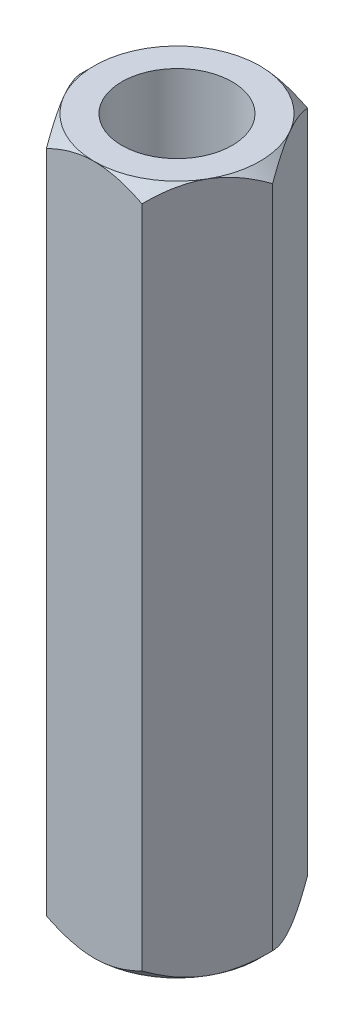
ISO-10303-21;
HEADER;
FILE_DESCRIPTION(('STEP AP214'),'2;1');
FILE_NAME('part.step','',(''),(''),'','','');
FILE_SCHEMA(('AUTOMOTIVE_DESIGN { 1 0 10303 214 1 1 1 1 }'));
ENDSEC;
DATA;
#1=APPLICATION_CONTEXT('core data for automotive mechanical design processes');
#2=APPLICATION_PROTOCOL_DEFINITION('international standard','automotive_design',2000,#1);
#3=PRODUCT_CONTEXT('',#1,'mechanical');
#4=PRODUCT('Part','Part','',(#3));
#5=PRODUCT_RELATED_PRODUCT_CATEGORY('part','',(#4));
#6=PRODUCT_DEFINITION_FORMATION('','',#4);
#7=PRODUCT_DEFINITION_CONTEXT('part definition',#1,'design');
#8=PRODUCT_DEFINITION('design','',#6,#7);
#9=PRODUCT_DEFINITION_SHAPE('','',#8);
#10=(LENGTH_UNIT() NAMED_UNIT(*) SI_UNIT(.MILLI.,.METRE.));
#11=(NAMED_UNIT(*) PLANE_ANGLE_UNIT() SI_UNIT($,.RADIAN.));
#12=(NAMED_UNIT(*) SI_UNIT($,.STERADIAN.) SOLID_ANGLE_UNIT());
#13=UNCERTAINTY_MEASURE_WITH_UNIT(LENGTH_MEASURE(1.E-05),#10,'distance_accuracy_value','');
#14=(GEOMETRIC_REPRESENTATION_CONTEXT(3) GLOBAL_UNCERTAINTY_ASSIGNED_CONTEXT((#13)) GLOBAL_UNIT_ASSIGNED_CONTEXT((#10,
#11,#12)) REPRESENTATION_CONTEXT('',''));
#15=CARTESIAN_POINT('',(0.,0.,0.));
#16=DIRECTION('',(0.,0.,1.));
#17=DIRECTION('',(1.,0.,0.));
#18=AXIS2_PLACEMENT_3D('',#15,#16,#17);
#19=CARTESIAN_POINT('',(0.,0.500000000000007,0.));
#20=DIRECTION('',(0.,1.,0.));
#21=DIRECTION('',(0.,0.,1.));
#22=AXIS2_PLACEMENT_3D('',#19,#20,#21);
#23=CONICAL_SURFACE('',#22,3.5,0.785398163397449);
#24=CARTESIAN_POINT('',(-3.62915516946139,1.70858442039945,-3.));
#25=CARTESIAN_POINT('',(-3.54153211272357,1.64106383964874,-3.));
#26=CARTESIAN_POINT('',(-3.45343857910553,1.57414424358293,-3.));
#27=CARTESIAN_POINT('',(-3.27611767023116,1.44178206977251,-3.));
#28=CARTESIAN_POINT('',(-3.18689003301499,1.37633984333659,-3.));
#29=CARTESIAN_POINT('',(-3.00645615703304,1.24674179351404,-3.));
#30=CARTESIAN_POINT('',(-2.91523996696214,1.18259977975863,-3.));
#31=CARTESIAN_POINT('',(-2.73129233813018,1.05653409897249,-3.));
#32=CARTESIAN_POINT('',(-2.63856100412977,0.994610279507754,-3.));
#33=CARTESIAN_POINT('',(-2.44533724608063,0.869612511053117,-3.));
#34=CARTESIAN_POINT('',(-2.34472785867827,0.806718459888562,-3.));
#35=CARTESIAN_POINT('',(-2.14114550054073,0.684814079831247,-3.));
#36=CARTESIAN_POINT('',(-2.03817213392274,0.625804407928502,-3.));
#37=CARTESIAN_POINT('',(-1.82983029570639,0.51292396153963,-3.));
#38=CARTESIAN_POINT('',(-1.7244700593887,0.459038106157615,-3.));
#39=CARTESIAN_POINT('',(-1.51076215022669,0.35761264365954,-3.));
#40=CARTESIAN_POINT('',(-1.40241592112307,0.310070032324291,-3.));
#41=CARTESIAN_POINT('',(-1.19351356903438,0.227417700688498,-3.));
#42=CARTESIAN_POINT('',(-1.09326459374811,0.19153955198719,-3.));
#43=CARTESIAN_POINT('',(-0.890200209830102,0.127806349234589,-3.));
#44=CARTESIAN_POINT('',(-0.787384639242509,0.0999518028818651,-3.));
#45=CARTESIAN_POINT('',(-0.581599261083371,0.0542429165694934,-3.));
#46=CARTESIAN_POINT('',(-0.478670701177195,0.0362060063657986,-3.));
#47=CARTESIAN_POINT('',(-0.271518989647604,0.0105108354955751,-3.));
#48=CARTESIAN_POINT('',(-0.167296115765581,0.00285038573657599,-3.));
#49=CARTESIAN_POINT('',(0.0367444409571021,-0.00143200142632967,-3.));
#50=CARTESIAN_POINT('',(0.136552226306096,0.00147099470424015,-3.));
#51=CARTESIAN_POINT('',(0.335394703234642,0.0170615426560572,-3.));
#52=CARTESIAN_POINT('',(0.434429324258312,0.029749977153982,-3.));
#53=CARTESIAN_POINT('',(0.632691071428618,0.0644064382023402,-3.));
#54=CARTESIAN_POINT('',(0.731889017547279,0.0865388384199268,-3.));
#55=CARTESIAN_POINT('',(0.928087752283968,0.138854552391757,-3.));
#56=CARTESIAN_POINT('',(1.025088659875,0.169037429064066,-3.));
#57=CARTESIAN_POINT('',(1.32303847202931,0.273297170862195,-3.));
#58=CARTESIAN_POINT('',(1.51995647787793,0.358929121273109,-3.));
#59=CARTESIAN_POINT('',(1.80816132365907,0.501784416731365,-3.));
#60=CARTESIAN_POINT('',(1.90321056386665,0.551914744879703,-3.));
#61=CARTESIAN_POINT('',(2.09115832776568,0.656065752065302,-3.));
#62=CARTESIAN_POINT('',(2.18405722520674,0.710085748229744,-3.));
#63=CARTESIAN_POINT('',(2.36341629302006,0.818493264869271,-3.));
#64=CARTESIAN_POINT('',(2.44996796973321,0.872731093237622,-3.));
#65=CARTESIAN_POINT('',(2.62158614081252,0.983518717930569,-3.));
#66=CARTESIAN_POINT('',(2.70665252324365,1.04006868743918,-3.));
#67=CARTESIAN_POINT('',(2.87480881037171,1.15460705271806,-3.));
#68=CARTESIAN_POINT('',(2.95790909584796,1.21258027142174,-3.));
#69=CARTESIAN_POINT('',(3.12296934949583,1.33008223168144,-3.));
#70=CARTESIAN_POINT('',(3.20492962572986,1.38961053998278,-3.));
#71=CARTESIAN_POINT('',(3.28641186513492,1.44977560639856,-3.));
#72=B_SPLINE_CURVE_WITH_KNOTS('',3,(#24,#25,#26,#27,#28,#29,#30,#31,#32,#33,#34,#35,#36,#37,#38,
#39,#40,#41,#42,#43,#44,#45,#46,#47,#48,#49,#50,#51,#52,#53,#54,#55,#56,#57,#58,#59,#60,#61,#62,
#63,#64,#65,#66,#67,#68,#69,#70,#71),.UNSPECIFIED.,.F.,.F.,(4,2,2,2,2,2,2,2,2,2,2,2,2,2,2,2,2,2,
2,2,2,2,2,4),(0.,0.331866650070184,0.663811401823761,0.998315636961953,1.33279684074203,
1.68867823332011,2.04461966455837,2.39947873662204,2.75416914299926,3.07332171437226,
3.39249447589447,3.70550928437776,4.01845804672319,4.31751013104958,4.61658919395056,
4.92110091424744,5.22559610515134,5.8678028963333,6.19015191365859,6.51244447650363,
6.81883228207377,7.12524307889909,7.42919599459991,7.73306511230724),.UNSPECIFIED.);
#73=CARTESIAN_POINT('',(0.,0.,-3.));
#74=VERTEX_POINT('',#73);
#75=CARTESIAN_POINT('',(1.73205080756888,0.464101615137761,-3.));
#76=VERTEX_POINT('',#75);
#77=EDGE_CURVE('E185',#74,#76,#72,.T.);
#78=ORIENTED_EDGE('',*,*,#77,.T.);
#79=CARTESIAN_POINT('',(1.73193533751504,0.46421709096491,-3.0002));
#80=CARTESIAN_POINT('',(1.79147372663452,0.404729933459547,-2.89707648504425));
#81=CARTESIAN_POINT('',(1.85200767512883,0.34873659460328,-2.79222861066935));
#82=CARTESIAN_POINT('',(1.97544301635334,0.246214211516703,-2.57843232821891));
#83=CARTESIAN_POINT('',(2.03835614749388,0.199742208879052,-2.46946358862024));
#84=CARTESIAN_POINT('',(2.16521745390422,0.120134803654059,-2.24973336040297));
#85=CARTESIAN_POINT('',(2.22913332270056,0.0867993157804289,-2.13902782823779));
#86=CARTESIAN_POINT('',(2.35837216363117,0.0354391591170664,-1.91517958943468));
#87=CARTESIAN_POINT('',(2.42369118784644,0.0173761526733633,-1.80204372079301));
#88=CARTESIAN_POINT('',(2.53626564359199,0.00107852358825792,-1.6070590438073));
#89=CARTESIAN_POINT('',(2.58337569224233,-0.0013340176884317,-1.52546204599787));
#90=CARTESIAN_POINT('',(2.67751916315865,0.00273104979487442,-1.36240077116991));
#91=CARTESIAN_POINT('',(2.72455255277569,0.00921177516606669,-1.28093655070101));
#92=CARTESIAN_POINT('',(2.81817374583237,0.0306933376529837,-1.11877988766163));
#93=CARTESIAN_POINT('',(2.86476099147974,0.0457037051050389,-1.0380884112157));
#94=CARTESIAN_POINT('',(2.95713536549225,0.0834252612037733,-0.878091302108669));
#95=CARTESIAN_POINT('',(3.00292255491614,0.106135859460591,-0.798785563690708));
#96=CARTESIAN_POINT('',(3.0842086834051,0.152862299991702,-0.657993859197251));
#97=CARTESIAN_POINT('',(3.11988753362891,0.175649942818558,-0.596196277853978));
#98=CARTESIAN_POINT('',(3.19060468282508,0.224897901195206,-0.473710582479783));
#99=CARTESIAN_POINT('',(3.2256429622163,0.251358328803956,-0.413022502364399));
#100=CARTESIAN_POINT('',(3.29496858432307,0.307358609529121,-0.29294700260914));
#101=CARTESIAN_POINT('',(3.3292578988429,0.336888779616129,-0.233556167704084));
#102=CARTESIAN_POINT('',(3.39720147685868,0.398640706713288,-0.115874438532733));
#103=CARTESIAN_POINT('',(3.43085611477446,0.430860811797116,-0.0575828957522673));
#104=CARTESIAN_POINT('',(3.46421708519159,0.46421709096491,0.000199999999998762));
#105=B_SPLINE_CURVE_WITH_KNOTS('',3,(#79,#80,#81,#82,#83,#84,#85,#86,#87,#88,#89,#90,#91,#92,
#93,#94,#95,#96,#97,#98,#99,#100,#101,#102,#103,#104),.UNSPECIFIED.,.F.,.F.,(4,2,2,2,2,2,2,2,2,
2,2,2,4),(0.,0.399603557139306,0.801535286397843,1.19708369162343,1.59163620080173,
1.87398941755844,2.15644160919092,2.43921001247425,2.72195674032137,2.94657516661926,
3.17120044767274,3.3951375283781,3.61893808380739),.UNSPECIFIED.);
#106=CARTESIAN_POINT('',(2.59807621135332,0.,-1.5));
#107=VERTEX_POINT('',#106);
#108=EDGE_CURVE('E323',#76,#107,#105,.T.);
#109=ORIENTED_EDGE('',*,*,#108,.T.);
#110=CARTESIAN_POINT('',(0.,0.,0.));
#111=DIRECTION('',(0.,1.,0.));
#112=DIRECTION('',(0.,0.,1.));
#113=AXIS2_PLACEMENT_3D('',#110,#111,#112);
#114=CIRCLE('',#113,2.99999999999999);
#115=EDGE_CURVE('E317',#74,#107,#114,.F.);
#116=ORIENTED_EDGE('',*,*,#115,.F.);
#117=EDGE_LOOP('',(#78,#109,#116));
#118=FACE_BOUND('',#117,.T.);
#119=ADVANCED_FACE('F35',(#118),#23,.T.);
#120=CARTESIAN_POINT('',(2.59807621135332,0.,1.5));
#121=VERTEX_POINT('',#120);
#122=EDGE_CURVE('E313',#107,#121,#114,.F.);
#123=ORIENTED_EDGE('',*,*,#122,.F.);
#124=CARTESIAN_POINT('',(3.46410161513775,0.464101615137761,0.));
#125=VERTEX_POINT('',#124);
#126=EDGE_CURVE('E237',#107,#125,#105,.T.);
#127=ORIENTED_EDGE('',*,*,#126,.T.);
#128=CARTESIAN_POINT('',(3.46421708519159,0.464217090964909,-0.000200000000001599));
#129=CARTESIAN_POINT('',(3.40467869607211,0.404729933459547,0.102923514955746));
#130=CARTESIAN_POINT('',(3.3441447475778,0.34873659460328,0.207771389330648));
#131=CARTESIAN_POINT('',(3.22070940635329,0.246214211516702,0.421567671781094));
#132=CARTESIAN_POINT('',(3.15779627521275,0.199742208879052,0.530536411379758));
#133=CARTESIAN_POINT('',(3.03093496880241,0.120134803654059,0.750266639597026));
#134=CARTESIAN_POINT('',(2.96701910000607,0.0867993157804283,0.860972171762209));
#135=CARTESIAN_POINT('',(2.83778025907546,0.0354391591170657,1.08482041056532));
#136=CARTESIAN_POINT('',(2.7724612348602,0.0173761526733626,1.19795627920699));
#137=CARTESIAN_POINT('',(2.65988677911464,0.00107852358825726,1.3929409561927));
#138=CARTESIAN_POINT('',(2.6127767304643,-0.00133401768843233,1.47453795400213));
#139=CARTESIAN_POINT('',(2.51863325954798,0.00273104979487411,1.63759922883009));
#140=CARTESIAN_POINT('',(2.47159986993094,0.00921177516606667,1.71906344929898));
#141=CARTESIAN_POINT('',(2.37797867687426,0.0306933376529836,1.88122011233837));
#142=CARTESIAN_POINT('',(2.33139143122689,0.0457037051050385,1.9619115887843));
#143=CARTESIAN_POINT('',(2.23901705721439,0.0834252612037727,2.12190869789133));
#144=CARTESIAN_POINT('',(2.19322986779049,0.106135859460591,2.20121443630929));
#145=CARTESIAN_POINT('',(2.11194373930153,0.152862299991702,2.34200614080275));
#146=CARTESIAN_POINT('',(2.07626488907772,0.175649942818558,2.40380372214602));
#147=CARTESIAN_POINT('',(2.00554773988155,0.224897901195205,2.52628941752022));
#148=CARTESIAN_POINT('',(1.97050946049034,0.251358328803956,2.5869774976356));
#149=CARTESIAN_POINT('',(1.90118383838356,0.30735860952912,2.70705299739086));
#150=CARTESIAN_POINT('',(1.86689452386373,0.336888779616129,2.76644383229592));
#151=CARTESIAN_POINT('',(1.79895094584795,0.398640706713289,2.88412556146727));
#152=CARTESIAN_POINT('',(1.76529630793217,0.430860811797116,2.94241710424773));
#153=CARTESIAN_POINT('',(1.73193533751504,0.464217090964909,3.0002));
#154=B_SPLINE_CURVE_WITH_KNOTS('',3,(#128,#129,#130,#131,#132,#133,#134,#135,#136,#137,#138,
#139,#140,#141,#142,#143,#144,#145,#146,#147,#148,#149,#150,#151,#152,#153),.UNSPECIFIED.,.F.,
.F.,(4,2,2,2,2,2,2,2,2,2,2,2,4),(0.,0.399603557139306,0.801535286397844,1.19708369162343,
1.59163620080173,1.87398941755844,2.15644160919092,2.43921001247425,2.72195674032138,
2.94657516661926,3.17120044767274,3.3951375283781,3.61893808380739),.UNSPECIFIED.);
#155=EDGE_CURVE('E235',#125,#121,#154,.T.);
#156=ORIENTED_EDGE('',*,*,#155,.T.);
#157=EDGE_LOOP('',(#123,#127,#156));
#158=FACE_BOUND('',#157,.T.);
#159=ADVANCED_FACE('F205',(#158),#23,.T.);
#160=CARTESIAN_POINT('',(0.,0.,3.));
#161=VERTEX_POINT('',#160);
#162=EDGE_CURVE('E307',#121,#161,#114,.F.);
#163=ORIENTED_EDGE('',*,*,#162,.F.);
#164=CARTESIAN_POINT('',(1.73205080756888,0.464101615137761,3.));
#165=VERTEX_POINT('',#164);
#166=EDGE_CURVE('E228',#121,#165,#154,.T.);
#167=ORIENTED_EDGE('',*,*,#166,.T.);
#168=CARTESIAN_POINT('',(-3.62915516946139,1.70858442039944,3.));
#169=CARTESIAN_POINT('',(-3.54153211272357,1.64106383964874,3.));
#170=CARTESIAN_POINT('',(-3.45343857910553,1.57414424358292,3.));
#171=CARTESIAN_POINT('',(-3.27611767023116,1.44178206977251,3.));
#172=CARTESIAN_POINT('',(-3.18689003301498,1.37633984333659,3.));
#173=CARTESIAN_POINT('',(-3.00645615703303,1.24674179351404,3.));
#174=CARTESIAN_POINT('',(-2.91523996696214,1.18259977975862,3.));
#175=CARTESIAN_POINT('',(-2.73129233813017,1.05653409897249,3.));
#176=CARTESIAN_POINT('',(-2.63856100412976,0.994610279507752,3.));
#177=CARTESIAN_POINT('',(-2.44533724608063,0.869612511053115,3.));
#178=CARTESIAN_POINT('',(-2.34472785867827,0.806718459888561,3.));
#179=CARTESIAN_POINT('',(-2.14114550054073,0.684814079831246,3.));
#180=CARTESIAN_POINT('',(-2.03817213392274,0.6258044079285,3.));
#181=CARTESIAN_POINT('',(-1.82983029570639,0.512923961539629,3.));
#182=CARTESIAN_POINT('',(-1.7244700593887,0.459038106157615,3.));
#183=CARTESIAN_POINT('',(-1.51076215022669,0.35761264365954,3.));
#184=CARTESIAN_POINT('',(-1.40241592112307,0.31007003232429,3.));
#185=CARTESIAN_POINT('',(-1.19351356903437,0.227417700688496,3.));
#186=CARTESIAN_POINT('',(-1.09326459374811,0.191539551987188,3.));
#187=CARTESIAN_POINT('',(-0.890200209830101,0.127806349234588,3.));
#188=CARTESIAN_POINT('',(-0.787384639242507,0.0999518028818644,3.));
#189=CARTESIAN_POINT('',(-0.581599261083369,0.0542429165694928,3.));
#190=CARTESIAN_POINT('',(-0.478670701177193,0.0362060063657979,3.));
#191=CARTESIAN_POINT('',(-0.271518989647602,0.0105108354955744,3.));
#192=CARTESIAN_POINT('',(-0.167296115765579,0.00285038573657535,3.));
#193=CARTESIAN_POINT('',(0.0367444409571041,-0.00143200142633001,3.));
#194=CARTESIAN_POINT('',(0.136552226306098,0.00147099470423996,3.));
#195=CARTESIAN_POINT('',(0.335394703234644,0.0170615426560572,3.));
#196=CARTESIAN_POINT('',(0.434429324258314,0.0297499771539819,3.));
#197=CARTESIAN_POINT('',(0.632691071428619,0.06440643820234,3.));
#198=CARTESIAN_POINT('',(0.731889017547281,0.0865388384199265,3.));
#199=CARTESIAN_POINT('',(0.928087752283969,0.138854552391757,3.));
#200=CARTESIAN_POINT('',(1.025088659875,0.169037429064065,3.));
#201=CARTESIAN_POINT('',(1.32303847202931,0.273297170862194,3.));
#202=CARTESIAN_POINT('',(1.51995647787794,0.358929121273108,3.));
#203=CARTESIAN_POINT('',(1.80816132365907,0.501784416731365,3.));
#204=CARTESIAN_POINT('',(1.90321056386665,0.551914744879703,3.));
#205=CARTESIAN_POINT('',(2.09115832776568,0.656065752065304,3.));
#206=CARTESIAN_POINT('',(2.18405722520675,0.710085748229745,3.));
#207=CARTESIAN_POINT('',(2.36341629302007,0.818493264869273,3.));
#208=CARTESIAN_POINT('',(2.44996796973321,0.872731093237624,3.));
#209=CARTESIAN_POINT('',(2.62158614081252,0.983518717930571,3.));
#210=CARTESIAN_POINT('',(2.70665252324366,1.04006868743918,3.));
#211=CARTESIAN_POINT('',(2.87480881037172,1.15460705271807,3.));
#212=CARTESIAN_POINT('',(2.95790909584797,1.21258027142174,3.));
#213=CARTESIAN_POINT('',(3.12296934949583,1.33008223168144,3.));
#214=CARTESIAN_POINT('',(3.20492962572986,1.38961053998278,3.));
#215=CARTESIAN_POINT('',(3.28641186513493,1.44977560639856,3.));
#216=B_SPLINE_CURVE_WITH_KNOTS('',3,(#168,#169,#170,#171,#172,#173,#174,#175,#176,#177,#178,
#179,#180,#181,#182,#183,#184,#185,#186,#187,#188,#189,#190,#191,#192,#193,#194,#195,#196,#197,
#198,#199,#200,#201,#202,#203,#204,#205,#206,#207,#208,#209,#210,#211,#212,#213,#214,#215),
.UNSPECIFIED.,.F.,.F.,(4,2,2,2,2,2,2,2,2,2,2,2,2,2,2,2,2,2,2,2,2,2,2,4),(0.,0.331866650070184,
0.66381140182376,0.998315636961951,1.33279684074203,1.68867823332011,2.04461966455837,
2.39947873662203,2.75416914299925,3.07332171437226,3.39249447589447,3.70550928437776,
4.01845804672319,4.31751013104958,4.61658919395056,4.92110091424744,5.22559610515134,
5.8678028963333,6.19015191365858,6.51244447650363,6.81883228207377,7.12524307889909,
7.42919599459991,7.73306511230724),.UNSPECIFIED.);
#217=EDGE_CURVE('E236',#165,#161,#216,.F.);
#218=ORIENTED_EDGE('',*,*,#217,.T.);
#219=EDGE_LOOP('',(#163,#167,#218));
#220=FACE_BOUND('',#219,.T.);
#221=ADVANCED_FACE('F337',(#220),#23,.T.);
#222=CARTESIAN_POINT('',(-2.59807621135331,0.,1.5));
#223=VERTEX_POINT('',#222);
#224=EDGE_CURVE('E160',#161,#223,#114,.F.);
#225=ORIENTED_EDGE('',*,*,#224,.F.);
#226=CARTESIAN_POINT('',(-1.73205080756887,0.46410161513776,3.));
#227=VERTEX_POINT('',#226);
#228=EDGE_CURVE('E222',#161,#227,#216,.F.);
#229=ORIENTED_EDGE('',*,*,#228,.T.);
#230=CARTESIAN_POINT('',(-1.73193533751504,0.464217090964909,3.0002));
#231=CARTESIAN_POINT('',(-1.79147372663452,0.404729933459546,2.89707648504425));
#232=CARTESIAN_POINT('',(-1.85200767512883,0.348736594603279,2.79222861066935));
#233=CARTESIAN_POINT('',(-1.97544301635333,0.246214211516701,2.5784323282189));
#234=CARTESIAN_POINT('',(-2.03835614749388,0.199742208879051,2.46946358862024));
#235=CARTESIAN_POINT('',(-2.16521745390421,0.120134803654058,2.24973336040297));
#236=CARTESIAN_POINT('',(-2.22913332270056,0.0867993157804272,2.13902782823779));
#237=CARTESIAN_POINT('',(-2.35837216363117,0.0354391591170648,1.91517958943468));
#238=CARTESIAN_POINT('',(-2.42369118784643,0.017376152673362,1.80204372079301));
#239=CARTESIAN_POINT('',(-2.53626564359199,0.00107852358825657,1.6070590438073));
#240=CARTESIAN_POINT('',(-2.58337569224233,-0.00133401768843327,1.52546204599787));
#241=CARTESIAN_POINT('',(-2.67751916315865,0.00273104979487285,1.36240077116991));
#242=CARTESIAN_POINT('',(-2.72455255277569,0.00921177516606533,1.28093655070101));
#243=CARTESIAN_POINT('',(-2.81817374583237,0.0306933376529824,1.11877988766163));
#244=CARTESIAN_POINT('',(-2.86476099147974,0.0457037051050376,1.0380884112157));
#245=CARTESIAN_POINT('',(-2.95713536549224,0.0834252612037719,0.878091302108668));
#246=CARTESIAN_POINT('',(-3.00292255491614,0.10613585946059,0.798785563690708));
#247=CARTESIAN_POINT('',(-3.0842086834051,0.152862299991701,0.657993859197251));
#248=CARTESIAN_POINT('',(-3.11988753362891,0.175649942818557,0.596196277853978));
#249=CARTESIAN_POINT('',(-3.19060468282508,0.224897901195204,0.473710582479783));
#250=CARTESIAN_POINT('',(-3.22564296221629,0.251358328803955,0.413022502364399));
#251=CARTESIAN_POINT('',(-3.29496858432307,0.307358609529119,0.29294700260914));
#252=CARTESIAN_POINT('',(-3.3292578988429,0.336888779616128,0.233556167704084));
#253=CARTESIAN_POINT('',(-3.39720147685868,0.398640706713287,0.115874438532733));
#254=CARTESIAN_POINT('',(-3.43085611477446,0.430860811797115,0.0575828957522675));
#255=CARTESIAN_POINT('',(-3.46421708519159,0.464217090964908,-0.000199999999998781));
#256=B_SPLINE_CURVE_WITH_KNOTS('',3,(#230,#231,#232,#233,#234,#235,#236,#237,#238,#239,#240,
#241,#242,#243,#244,#245,#246,#247,#248,#249,#250,#251,#252,#253,#254,#255),.UNSPECIFIED.,.F.,
.F.,(4,2,2,2,2,2,2,2,2,2,2,2,4),(0.,0.399603557139306,0.801535286397844,1.19708369162343,
1.59163620080173,1.87398941755844,2.15644160919092,2.43921001247425,2.72195674032137,
2.94657516661926,3.17120044767274,3.3951375283781,3.61893808380739),.UNSPECIFIED.);
#257=EDGE_CURVE('E286',#227,#223,#256,.T.);
#258=ORIENTED_EDGE('',*,*,#257,.T.);
#259=EDGE_LOOP('',(#225,#229,#258));
#260=FACE_BOUND('',#259,.T.);
#261=ADVANCED_FACE('F349',(#260),#23,.T.);
#262=CARTESIAN_POINT('',(-2.59807621135332,0.,-1.5));
#263=VERTEX_POINT('',#262);
#264=EDGE_CURVE('E306',#223,#263,#114,.F.);
#265=ORIENTED_EDGE('',*,*,#264,.F.);
#266=CARTESIAN_POINT('',(-3.46410161513775,0.46410161513776,0.));
#267=VERTEX_POINT('',#266);
#268=EDGE_CURVE('E216',#223,#267,#256,.T.);
#269=ORIENTED_EDGE('',*,*,#268,.T.);
#270=CARTESIAN_POINT('',(-3.46421708519159,0.464217090964908,0.000200000000001165));
#271=CARTESIAN_POINT('',(-3.40467869607211,0.404729933459546,-0.102923514955747));
#272=CARTESIAN_POINT('',(-3.3441447475778,0.348736594603279,-0.207771389330649));
#273=CARTESIAN_POINT('',(-3.22070940635329,0.246214211516701,-0.421567671781094));
#274=CARTESIAN_POINT('',(-3.15779627521275,0.199742208879051,-0.530536411379758));
#275=CARTESIAN_POINT('',(-3.03093496880241,0.120134803654058,-0.750266639597026));
#276=CARTESIAN_POINT('',(-2.96701910000606,0.0867993157804282,-0.86097217176221));
#277=CARTESIAN_POINT('',(-2.83778025907546,0.035439159117066,-1.08482041056532));
#278=CARTESIAN_POINT('',(-2.77246123486019,0.017376152673363,-1.19795627920699));
#279=CARTESIAN_POINT('',(-2.65988677911464,0.00107852358825743,-1.3929409561927));
#280=CARTESIAN_POINT('',(-2.6127767304643,-0.0013340176884324,-1.47453795400213));
#281=CARTESIAN_POINT('',(-2.51863325954798,0.0027310497948735,-1.63759922883009));
#282=CARTESIAN_POINT('',(-2.47159986993094,0.00921177516606576,-1.71906344929898));
#283=CARTESIAN_POINT('',(-2.37797867687426,0.0306933376529828,-1.88122011233837));
#284=CARTESIAN_POINT('',(-2.33139143122689,0.0457037051050381,-1.9619115887843));
#285=CARTESIAN_POINT('',(-2.23901705721439,0.0834252612037724,-2.12190869789133));
#286=CARTESIAN_POINT('',(-2.19322986779049,0.10613585946059,-2.20121443630929));
#287=CARTESIAN_POINT('',(-2.11194373930153,0.152862299991701,-2.34200614080275));
#288=CARTESIAN_POINT('',(-2.07626488907772,0.175649942818558,-2.40380372214602));
#289=CARTESIAN_POINT('',(-2.00554773988155,0.224897901195205,-2.52628941752022));
#290=CARTESIAN_POINT('',(-1.97050946049034,0.251358328803956,-2.5869774976356));
#291=CARTESIAN_POINT('',(-1.90118383838356,0.30735860952912,-2.70705299739086));
#292=CARTESIAN_POINT('',(-1.86689452386373,0.336888779616129,-2.76644383229592));
#293=CARTESIAN_POINT('',(-1.79895094584795,0.398640706713289,-2.88412556146727));
#294=CARTESIAN_POINT('',(-1.76529630793217,0.430860811797116,-2.94241710424773));
#295=CARTESIAN_POINT('',(-1.73193533751504,0.46421709096491,-3.0002));
#296=B_SPLINE_CURVE_WITH_KNOTS('',3,(#270,#271,#272,#273,#274,#275,#276,#277,#278,#279,#280,
#281,#282,#283,#284,#285,#286,#287,#288,#289,#290,#291,#292,#293,#294,#295),.UNSPECIFIED.,.F.,
.F.,(4,2,2,2,2,2,2,2,2,2,2,2,4),(0.,0.399603557139306,0.801535286397844,1.19708369162343,
1.59163620080173,1.87398941755844,2.15644160919092,2.43921001247424,2.72195674032137,
2.94657516661926,3.17120044767274,3.3951375283781,3.61893808380739),.UNSPECIFIED.);
#297=EDGE_CURVE('E343',#267,#263,#296,.T.);
#298=ORIENTED_EDGE('',*,*,#297,.T.);
#299=EDGE_LOOP('',(#265,#269,#298));
#300=FACE_BOUND('',#299,.T.);
#301=ADVANCED_FACE('F373',(#300),#23,.T.);
#302=EDGE_CURVE('E312',#263,#74,#114,.F.);
#303=ORIENTED_EDGE('',*,*,#302,.F.);
#304=CARTESIAN_POINT('',(-1.73205080756888,0.464101615137762,-3.));
#305=VERTEX_POINT('',#304);
#306=EDGE_CURVE('E196',#263,#305,#296,.T.);
#307=ORIENTED_EDGE('',*,*,#306,.T.);
#308=EDGE_CURVE('E193',#305,#74,#72,.T.);
#309=ORIENTED_EDGE('',*,*,#308,.T.);
#310=EDGE_LOOP('',(#303,#307,#309));
#311=FACE_BOUND('',#310,.T.);
#312=ADVANCED_FACE('F207',(#311),#23,.T.);
#313=CARTESIAN_POINT('',(0.,25.,0.));
#314=DIRECTION('',(0.,-1.,0.));
#315=DIRECTION('',(0.,0.,-1.));
#316=AXIS2_PLACEMENT_3D('',#313,#314,#315);
#317=CONICAL_SURFACE('',#316,3.,0.785398163397445);
#318=CARTESIAN_POINT('',(-3.46421708519159,24.5357829090351,-0.000199999999999161));
#319=CARTESIAN_POINT('',(-3.40467869607211,24.5952700665405,0.102923514955748));
#320=CARTESIAN_POINT('',(-3.3441447475778,24.6512634053967,0.20777138933065));
#321=CARTESIAN_POINT('',(-3.22070940635329,24.7537857884833,0.421567671781094));
#322=CARTESIAN_POINT('',(-3.15779627521275,24.800257791121,0.530536411379757));
#323=CARTESIAN_POINT('',(-3.03093496880242,24.8798651963459,0.750266639597024));
#324=CARTESIAN_POINT('',(-2.96701910000607,24.9132006842196,0.860972171762206));
#325=CARTESIAN_POINT('',(-2.83778025907547,24.9645608408829,1.08482041056532));
#326=CARTESIAN_POINT('',(-2.7724612348602,24.9826238473266,1.19795627920698));
#327=CARTESIAN_POINT('',(-2.65988677911465,24.9989214764118,1.39294095619269));
#328=CARTESIAN_POINT('',(-2.61277673046431,25.0013340176884,1.47453795400212));
#329=CARTESIAN_POINT('',(-2.51863325954798,24.9972689502051,1.63759922883008));
#330=CARTESIAN_POINT('',(-2.47159986993094,24.9907882248339,1.71906344929897));
#331=CARTESIAN_POINT('',(-2.37797867687427,24.969306662347,1.88122011233835));
#332=CARTESIAN_POINT('',(-2.3313914312269,24.954296294895,1.96191158878429));
#333=CARTESIAN_POINT('',(-2.23901705721439,24.9165747387962,2.12190869789132));
#334=CARTESIAN_POINT('',(-2.1932298677905,24.8938641405394,2.20121443630928));
#335=CARTESIAN_POINT('',(-2.11194373930154,24.8471377000083,2.34200614080273));
#336=CARTESIAN_POINT('',(-2.07626488907773,24.8243500571815,2.40380372214601));
#337=CARTESIAN_POINT('',(-2.00554773988156,24.7751020988048,2.52628941752021));
#338=CARTESIAN_POINT('',(-1.97050946049034,24.7486416711961,2.58697749763559));
#339=CARTESIAN_POINT('',(-1.90118383838356,24.6926413904709,2.70705299739085));
#340=CARTESIAN_POINT('',(-1.86689452386373,24.6631112203839,2.76644383229591));
#341=CARTESIAN_POINT('',(-1.79895094584795,24.6013592932867,2.88412556146727));
#342=CARTESIAN_POINT('',(-1.76529630793216,24.5691391882029,2.94241710424773));
#343=CARTESIAN_POINT('',(-1.73193533751504,24.5357829090351,3.0002));
#344=B_SPLINE_CURVE_WITH_KNOTS('',3,(#318,#319,#320,#321,#322,#323,#324,#325,#326,#327,#328,
#329,#330,#331,#332,#333,#334,#335,#336,#337,#338,#339,#340,#341,#342,#343),.UNSPECIFIED.,.F.,
.F.,(4,2,2,2,2,2,2,2,2,2,2,2,4),(0.,0.399603557139306,0.801535286397842,1.19708369162342,
1.59163620080172,1.87398941755843,2.15644160919091,2.43921001247423,2.72195674032136,
2.94657516661925,3.17120044767273,3.3951375283781,3.61893808380739),.UNSPECIFIED.);
#345=CARTESIAN_POINT('',(-2.59807621135331,25.,1.5));
#346=VERTEX_POINT('',#345);
#347=CARTESIAN_POINT('',(-1.73205080756887,24.5358983848622,3.));
#348=VERTEX_POINT('',#347);
#349=EDGE_CURVE('E265',#346,#348,#344,.T.);
#350=ORIENTED_EDGE('',*,*,#349,.T.);
#351=CARTESIAN_POINT('',(-3.62915516946138,23.2914155796006,3.));
#352=CARTESIAN_POINT('',(-3.54153211272356,23.3589361603513,3.));
#353=CARTESIAN_POINT('',(-3.45343857910552,23.4258557564171,3.));
#354=CARTESIAN_POINT('',(-3.27611767023115,23.5582179302275,3.));
#355=CARTESIAN_POINT('',(-3.18689003301498,23.6236601566634,3.));
#356=CARTESIAN_POINT('',(-3.00645615703303,23.753258206486,3.));
#357=CARTESIAN_POINT('',(-2.91523996696213,23.8174002202414,3.));
#358=CARTESIAN_POINT('',(-2.73129233813017,23.9434659010275,3.));
#359=CARTESIAN_POINT('',(-2.63856100412976,24.0053897204922,3.));
#360=CARTESIAN_POINT('',(-2.44533724608062,24.1303874889469,3.));
#361=CARTESIAN_POINT('',(-2.34472785867826,24.1932815401114,3.));
#362=CARTESIAN_POINT('',(-2.14114550054073,24.3151859201688,3.));
#363=CARTESIAN_POINT('',(-2.03817213392274,24.3741955920715,3.));
#364=CARTESIAN_POINT('',(-1.82983029570639,24.4870760384604,3.));
#365=CARTESIAN_POINT('',(-1.72447005938869,24.5409618938424,3.));
#366=CARTESIAN_POINT('',(-1.51076215022669,24.6423873563405,3.));
#367=CARTESIAN_POINT('',(-1.40241592112307,24.6899299676757,3.));
#368=CARTESIAN_POINT('',(-1.19351356903438,24.7725822993115,3.));
#369=CARTESIAN_POINT('',(-1.09326459374811,24.8084604480128,3.));
#370=CARTESIAN_POINT('',(-0.890200209830105,24.8721936507654,3.));
#371=CARTESIAN_POINT('',(-0.787384639242512,24.9000481971181,3.));
#372=CARTESIAN_POINT('',(-0.581599261083376,24.9457570834305,3.));
#373=CARTESIAN_POINT('',(-0.4786707011772,24.9637939936342,3.));
#374=CARTESIAN_POINT('',(-0.271518989647611,24.9894891645044,3.));
#375=CARTESIAN_POINT('',(-0.167296115765588,24.9971496142634,3.));
#376=CARTESIAN_POINT('',(0.0367444409570936,25.0014320014263,3.));
#377=CARTESIAN_POINT('',(0.136552226306087,24.9985290052958,3.));
#378=CARTESIAN_POINT('',(0.335394703234633,24.982938457344,3.));
#379=CARTESIAN_POINT('',(0.434429324258302,24.970250022846,3.));
#380=CARTESIAN_POINT('',(0.632691071428607,24.9355935617977,3.));
#381=CARTESIAN_POINT('',(0.731889017547268,24.9134611615801,3.));
#382=CARTESIAN_POINT('',(0.928087752283956,24.8611454476083,3.));
#383=CARTESIAN_POINT('',(1.02508865987499,24.8309625709359,3.));
#384=CARTESIAN_POINT('',(1.32303847202929,24.7267028291378,3.));
#385=CARTESIAN_POINT('',(1.51995647787791,24.6410708787269,3.));
#386=CARTESIAN_POINT('',(1.80816132365904,24.4982155832687,3.));
#387=CARTESIAN_POINT('',(1.90321056386661,24.4480852551203,3.));
#388=CARTESIAN_POINT('',(2.09115832776564,24.3439342479347,3.));
#389=CARTESIAN_POINT('',(2.18405722520671,24.2899142517703,3.));
#390=CARTESIAN_POINT('',(2.36341629302002,24.1815067351308,3.));
#391=CARTESIAN_POINT('',(2.44996796973317,24.1272689067624,3.));
#392=CARTESIAN_POINT('',(2.62158614081248,24.0164812820695,3.));
#393=CARTESIAN_POINT('',(2.70665252324361,23.9599313125608,3.));
#394=CARTESIAN_POINT('',(2.87480881037167,23.845392947282,3.));
#395=CARTESIAN_POINT('',(2.95790909584792,23.7874197285783,3.));
#396=CARTESIAN_POINT('',(3.12296934949578,23.6699177683186,3.));
#397=CARTESIAN_POINT('',(3.20492962572981,23.6103894600173,3.));
#398=CARTESIAN_POINT('',(3.28641186513487,23.5502243936015,3.));
#399=B_SPLINE_CURVE_WITH_KNOTS('',3,(#351,#352,#353,#354,#355,#356,#357,#358,#359,#360,#361,
#362,#363,#364,#365,#366,#367,#368,#369,#370,#371,#372,#373,#374,#375,#376,#377,#378,#379,#380,
#381,#382,#383,#384,#385,#386,#387,#388,#389,#390,#391,#392,#393,#394,#395,#396,#397,#398),
.UNSPECIFIED.,.F.,.F.,(4,2,2,2,2,2,2,2,2,2,2,2,2,2,2,2,2,2,2,2,2,2,2,4),(0.,0.331866650070184,
0.663811401823762,0.998315636961955,1.33279684074203,1.68867823332011,2.04461966455837,
2.39947873662203,2.75416914299925,3.07332171437226,3.39249447589446,3.70550928437775,
4.01845804672318,4.31751013104956,4.61658919395055,4.92110091424743,5.22559610515132,
5.86780289633327,6.19015191365854,6.51244447650358,6.81883228207372,7.12524307889903,
7.42919599459985,7.73306511230717),.UNSPECIFIED.);
#400=CARTESIAN_POINT('',(0.,25.,3.));
#401=VERTEX_POINT('',#400);
#402=EDGE_CURVE('E12',#348,#401,#399,.T.);
#403=ORIENTED_EDGE('',*,*,#402,.T.);
#404=CARTESIAN_POINT('',(0.,25.,0.));
#405=DIRECTION('',(0.,1.,0.));
#406=DIRECTION('',(0.,0.,1.));
#407=AXIS2_PLACEMENT_3D('',#404,#405,#406);
#408=CIRCLE('',#407,3.);
#409=EDGE_CURVE('E159',#346,#401,#408,.T.);
#410=ORIENTED_EDGE('',*,*,#409,.F.);
#411=EDGE_LOOP('',(#350,#403,#410));
#412=FACE_BOUND('',#411,.T.);
#413=ADVANCED_FACE('F37',(#412),#317,.T.);
#414=CARTESIAN_POINT('',(2.59807621135332,25.,1.5));
#415=VERTEX_POINT('',#414);
#416=EDGE_CURVE('E134',#401,#415,#408,.T.);
#417=ORIENTED_EDGE('',*,*,#416,.F.);
#418=CARTESIAN_POINT('',(1.73205080756888,24.5358983848622,3.));
#419=VERTEX_POINT('',#418);
#420=EDGE_CURVE('E40',#401,#419,#399,.T.);
#421=ORIENTED_EDGE('',*,*,#420,.T.);
#422=CARTESIAN_POINT('',(1.73193533751504,24.5357829090351,3.0002));
#423=CARTESIAN_POINT('',(1.79147372663452,24.5952700665405,2.89707648504425));
#424=CARTESIAN_POINT('',(1.85200767512883,24.6512634053967,2.79222861066935));
#425=CARTESIAN_POINT('',(1.97544301635334,24.7537857884833,2.5784323282189));
#426=CARTESIAN_POINT('',(2.03835614749388,24.800257791121,2.46946358862024));
#427=CARTESIAN_POINT('',(2.16521745390422,24.8798651963459,2.24973336040297));
#428=CARTESIAN_POINT('',(2.22913332270056,24.9132006842196,2.13902782823779));
#429=CARTESIAN_POINT('',(2.35837216363117,24.9645608408829,1.91517958943468));
#430=CARTESIAN_POINT('',(2.42369118784643,24.9826238473266,1.80204372079301));
#431=CARTESIAN_POINT('',(2.53626564359198,24.9989214764118,1.6070590438073));
#432=CARTESIAN_POINT('',(2.58337569224232,25.0013340176884,1.52546204599787));
#433=CARTESIAN_POINT('',(2.67751916315865,24.9972689502051,1.36240077116992));
#434=CARTESIAN_POINT('',(2.72455255277569,24.9907882248339,1.28093655070102));
#435=CARTESIAN_POINT('',(2.81817374583237,24.969306662347,1.11877988766164));
#436=CARTESIAN_POINT('',(2.86476099147973,24.954296294895,1.03808841121571));
#437=CARTESIAN_POINT('',(2.95713536549224,24.9165747387962,0.878091302108678));
#438=CARTESIAN_POINT('',(3.00292255491613,24.8938641405394,0.798785563690718));
#439=CARTESIAN_POINT('',(3.08420868340509,24.8471377000083,0.65799385919726));
#440=CARTESIAN_POINT('',(3.1198875336289,24.8243500571815,0.596196277853985));
#441=CARTESIAN_POINT('',(3.19060468282507,24.7751020988048,0.473710582479788));
#442=CARTESIAN_POINT('',(3.22564296221629,24.7486416711961,0.413022502364403));
#443=CARTESIAN_POINT('',(3.29496858432307,24.6926413904709,0.292947002609141));
#444=CARTESIAN_POINT('',(3.3292578988429,24.6631112203839,0.233556167704084));
#445=CARTESIAN_POINT('',(3.39720147685868,24.6013592932867,0.115874438532731));
#446=CARTESIAN_POINT('',(3.43085611477446,24.5691391882029,0.0575828957522649));
#447=CARTESIAN_POINT('',(3.46421708519159,24.5357829090351,-0.000200000000001626));
#448=B_SPLINE_CURVE_WITH_KNOTS('',3,(#422,#423,#424,#425,#426,#427,#428,#429,#430,#431,#432,
#433,#434,#435,#436,#437,#438,#439,#440,#441,#442,#443,#444,#445,#446,#447),.UNSPECIFIED.,.F.,
.F.,(4,2,2,2,2,2,2,2,2,2,2,2,4),(0.,0.399603557139307,0.801535286397844,1.19708369162343,
1.59163620080172,1.87398941755843,2.15644160919091,2.43921001247423,2.72195674032136,
2.94657516661925,3.17120044767274,3.3951375283781,3.61893808380739),.UNSPECIFIED.);
#449=EDGE_CURVE('E257',#419,#415,#448,.T.);
#450=ORIENTED_EDGE('',*,*,#449,.T.);
#451=EDGE_LOOP('',(#417,#421,#450));
#452=FACE_BOUND('',#451,.T.);
#453=ADVANCED_FACE('F298',(#452),#317,.T.);
#454=CARTESIAN_POINT('',(2.59807621135332,25.,-1.5));
#455=VERTEX_POINT('',#454);
#456=EDGE_CURVE('E157',#415,#455,#408,.T.);
#457=ORIENTED_EDGE('',*,*,#456,.F.);
#458=CARTESIAN_POINT('',(3.46410161513775,24.5358983848622,0.));
#459=VERTEX_POINT('',#458);
#460=EDGE_CURVE('E250',#415,#459,#448,.T.);
#461=ORIENTED_EDGE('',*,*,#460,.T.);
#462=CARTESIAN_POINT('',(3.46421708519159,24.5357829090351,0.000199999999998401));
#463=CARTESIAN_POINT('',(3.40467869607211,24.5952700665405,-0.102923514955749));
#464=CARTESIAN_POINT('',(3.3441447475778,24.6512634053967,-0.20777138933065));
#465=CARTESIAN_POINT('',(3.2207094063533,24.7537857884833,-0.421567671781094));
#466=CARTESIAN_POINT('',(3.15779627521275,24.800257791121,-0.530536411379757));
#467=CARTESIAN_POINT('',(3.03093496880242,24.8798651963459,-0.750266639597024));
#468=CARTESIAN_POINT('',(2.96701910000607,24.9132006842196,-0.860972171762207));
#469=CARTESIAN_POINT('',(2.83778025907547,24.9645608408829,-1.08482041056532));
#470=CARTESIAN_POINT('',(2.7724612348602,24.9826238473266,-1.19795627920699));
#471=CARTESIAN_POINT('',(2.65988677911465,24.9989214764117,-1.39294095619269));
#472=CARTESIAN_POINT('',(2.61277673046431,25.0013340176884,-1.47453795400212));
#473=CARTESIAN_POINT('',(2.51863325954798,24.9972689502051,-1.63759922883008));
#474=CARTESIAN_POINT('',(2.47159986993094,24.9907882248339,-1.71906344929898));
#475=CARTESIAN_POINT('',(2.37797867687427,24.969306662347,-1.88122011233836));
#476=CARTESIAN_POINT('',(2.3313914312269,24.954296294895,-1.96191158878429));
#477=CARTESIAN_POINT('',(2.23901705721439,24.9165747387962,-2.12190869789132));
#478=CARTESIAN_POINT('',(2.1932298677905,24.8938641405394,-2.20121443630928));
#479=CARTESIAN_POINT('',(2.11194373930154,24.8471377000083,-2.34200614080274));
#480=CARTESIAN_POINT('',(2.07626488907773,24.8243500571815,-2.40380372214601));
#481=CARTESIAN_POINT('',(2.00554773988156,24.7751020988048,-2.52628941752021));
#482=CARTESIAN_POINT('',(1.97050946049034,24.7486416711961,-2.58697749763559));
#483=CARTESIAN_POINT('',(1.90118383838356,24.6926413904709,-2.70705299739086));
#484=CARTESIAN_POINT('',(1.86689452386373,24.6631112203839,-2.76644383229591));
#485=CARTESIAN_POINT('',(1.79895094584795,24.6013592932867,-2.88412556146727));
#486=CARTESIAN_POINT('',(1.76529630793217,24.5691391882029,-2.94241710424773));
#487=CARTESIAN_POINT('',(1.73193533751504,24.5357829090351,-3.0002));
#488=B_SPLINE_CURVE_WITH_KNOTS('',3,(#462,#463,#464,#465,#466,#467,#468,#469,#470,#471,#472,
#473,#474,#475,#476,#477,#478,#479,#480,#481,#482,#483,#484,#485,#486,#487),.UNSPECIFIED.,.F.,
.F.,(4,2,2,2,2,2,2,2,2,2,2,2,4),(0.,0.399603557139304,0.801535286397839,1.19708369162342,
1.59163620080172,1.87398941755843,2.15644160919091,2.43921001247423,2.72195674032136,
2.94657516661925,3.17120044767273,3.3951375283781,3.61893808380739),.UNSPECIFIED.);
#489=EDGE_CURVE('E304',#459,#455,#488,.T.);
#490=ORIENTED_EDGE('',*,*,#489,.T.);
#491=EDGE_LOOP('',(#457,#461,#490));
#492=FACE_BOUND('',#491,.T.);
#493=ADVANCED_FACE('F303',(#492),#317,.T.);
#494=CARTESIAN_POINT('',(-1.73193533751504,24.5357829090351,-3.0002));
#495=CARTESIAN_POINT('',(-1.79147372663452,24.5952700665405,-2.89707648504425));
#496=CARTESIAN_POINT('',(-1.85200767512883,24.6512634053967,-2.79222861066935));
#497=CARTESIAN_POINT('',(-1.97544301635334,24.7537857884833,-2.5784323282189));
#498=CARTESIAN_POINT('',(-2.03835614749388,24.800257791121,-2.46946358862024));
#499=CARTESIAN_POINT('',(-2.16521745390422,24.8798651963459,-2.24973336040297));
#500=CARTESIAN_POINT('',(-2.22913332270057,24.9132006842196,-2.13902782823779));
#501=CARTESIAN_POINT('',(-2.35837216363117,24.9645608408829,-1.91517958943468));
#502=CARTESIAN_POINT('',(-2.42369118784643,24.9826238473266,-1.80204372079301));
#503=CARTESIAN_POINT('',(-2.53626564359198,24.9989214764118,-1.6070590438073));
#504=CARTESIAN_POINT('',(-2.58337569224232,25.0013340176884,-1.52546204599787));
#505=CARTESIAN_POINT('',(-2.67751916315865,24.9972689502051,-1.36240077116992));
#506=CARTESIAN_POINT('',(-2.72455255277569,24.9907882248339,-1.28093655070102));
#507=CARTESIAN_POINT('',(-2.81817374583237,24.969306662347,-1.11877988766164));
#508=CARTESIAN_POINT('',(-2.86476099147973,24.954296294895,-1.03808841121571));
#509=CARTESIAN_POINT('',(-2.95713536549224,24.9165747387962,-0.878091302108677));
#510=CARTESIAN_POINT('',(-3.00292255491613,24.8938641405394,-0.798785563690716));
#511=CARTESIAN_POINT('',(-3.08420868340509,24.8471377000083,-0.657993859197259));
#512=CARTESIAN_POINT('',(-3.1198875336289,24.8243500571815,-0.596196277853984));
#513=CARTESIAN_POINT('',(-3.19060468282507,24.7751020988048,-0.473710582479788));
#514=CARTESIAN_POINT('',(-3.22564296221629,24.7486416711961,-0.413022502364403));
#515=CARTESIAN_POINT('',(-3.29496858432307,24.6926413904709,-0.292947002609141));
#516=CARTESIAN_POINT('',(-3.3292578988429,24.6631112203839,-0.233556167704085));
#517=CARTESIAN_POINT('',(-3.39720147685868,24.6013592932867,-0.115874438532733));
#518=CARTESIAN_POINT('',(-3.43085611477446,24.5691391882029,-0.0575828957522663));
#519=CARTESIAN_POINT('',(-3.46421708519159,24.5357829090351,0.000200000000000976));
#520=B_SPLINE_CURVE_WITH_KNOTS('',3,(#494,#495,#496,#497,#498,#499,#500,#501,#502,#503,#504,
#505,#506,#507,#508,#509,#510,#511,#512,#513,#514,#515,#516,#517,#518,#519),.UNSPECIFIED.,.F.,
.F.,(4,2,2,2,2,2,2,2,2,2,2,2,4),(0.,0.399603557139308,0.801535286397845,1.19708369162343,
1.59163620080172,1.87398941755844,2.15644160919092,2.43921001247424,2.72195674032136,
2.94657516661926,3.17120044767274,3.3951375283781,3.61893808380739),.UNSPECIFIED.);
#521=CARTESIAN_POINT('',(-2.59807621135332,25.,-1.5));
#522=VERTEX_POINT('',#521);
#523=CARTESIAN_POINT('',(-3.46410161513775,24.5358983848622,0.));
#524=VERTEX_POINT('',#523);
#525=EDGE_CURVE('E264',#522,#524,#520,.T.);
#526=ORIENTED_EDGE('',*,*,#525,.T.);
#527=EDGE_CURVE('E258',#524,#346,#344,.T.);
#528=ORIENTED_EDGE('',*,*,#527,.T.);
#529=EDGE_CURVE('E151',#522,#346,#408,.T.);
#530=ORIENTED_EDGE('',*,*,#529,.F.);
#531=EDGE_LOOP('',(#526,#528,#530));
#532=FACE_BOUND('',#531,.T.);
#533=ADVANCED_FACE('F357',(#532),#317,.T.);
#534=CARTESIAN_POINT('',(0.,25.,-3.));
#535=VERTEX_POINT('',#534);
#536=EDGE_CURVE('E141',#455,#535,#408,.T.);
#537=ORIENTED_EDGE('',*,*,#536,.F.);
#538=CARTESIAN_POINT('',(1.73205080756888,24.5358983848622,-3.));
#539=VERTEX_POINT('',#538);
#540=EDGE_CURVE('E143',#455,#539,#488,.T.);
#541=ORIENTED_EDGE('',*,*,#540,.T.);
#542=CARTESIAN_POINT('',(-3.62915516946138,23.2914155796006,-3.));
#543=CARTESIAN_POINT('',(-3.54153211272357,23.3589361603513,-3.));
#544=CARTESIAN_POINT('',(-3.45343857910553,23.4258557564171,-3.));
#545=CARTESIAN_POINT('',(-3.27611767023116,23.5582179302275,-3.));
#546=CARTESIAN_POINT('',(-3.18689003301498,23.6236601566634,-3.));
#547=CARTESIAN_POINT('',(-3.00645615703304,23.753258206486,-3.));
#548=CARTESIAN_POINT('',(-2.91523996696214,23.8174002202414,-3.));
#549=CARTESIAN_POINT('',(-2.73129233813018,23.9434659010275,-3.));
#550=CARTESIAN_POINT('',(-2.63856100412977,24.0053897204922,-3.));
#551=CARTESIAN_POINT('',(-2.44533724608063,24.1303874889469,-3.));
#552=CARTESIAN_POINT('',(-2.34472785867827,24.1932815401114,-3.));
#553=CARTESIAN_POINT('',(-2.14114550054073,24.3151859201688,-3.));
#554=CARTESIAN_POINT('',(-2.03817213392274,24.3741955920715,-3.));
#555=CARTESIAN_POINT('',(-1.82983029570639,24.4870760384604,-3.));
#556=CARTESIAN_POINT('',(-1.7244700593887,24.5409618938424,-3.));
#557=CARTESIAN_POINT('',(-1.51076215022669,24.6423873563405,-3.));
#558=CARTESIAN_POINT('',(-1.40241592112307,24.6899299676757,-3.));
#559=CARTESIAN_POINT('',(-1.19351356903438,24.7725822993115,-3.));
#560=CARTESIAN_POINT('',(-1.09326459374811,24.8084604480128,-3.));
#561=CARTESIAN_POINT('',(-0.890200209830105,24.8721936507654,-3.));
#562=CARTESIAN_POINT('',(-0.787384639242513,24.9000481971181,-3.));
#563=CARTESIAN_POINT('',(-0.581599261083376,24.9457570834305,-3.));
#564=CARTESIAN_POINT('',(-0.4786707011772,24.9637939936342,-3.));
#565=CARTESIAN_POINT('',(-0.27151898964761,24.9894891645044,-3.));
#566=CARTESIAN_POINT('',(-0.167296115765587,24.9971496142634,-3.));
#567=CARTESIAN_POINT('',(0.0367444409570954,25.0014320014263,-3.));
#568=CARTESIAN_POINT('',(0.136552226306089,24.9985290052958,-3.));
#569=CARTESIAN_POINT('',(0.335394703234634,24.982938457344,-3.));
#570=CARTESIAN_POINT('',(0.434429324258304,24.970250022846,-3.));
#571=CARTESIAN_POINT('',(0.632691071428608,24.9355935617977,-3.));
#572=CARTESIAN_POINT('',(0.731889017547269,24.9134611615801,-3.));
#573=CARTESIAN_POINT('',(0.928087752283957,24.8611454476083,-3.));
#574=CARTESIAN_POINT('',(1.02508865987499,24.8309625709359,-3.));
#575=CARTESIAN_POINT('',(1.32303847202929,24.7267028291378,-3.));
#576=CARTESIAN_POINT('',(1.51995647787792,24.6410708787269,-3.));
#577=CARTESIAN_POINT('',(1.80816132365905,24.4982155832687,-3.));
#578=CARTESIAN_POINT('',(1.90321056386662,24.4480852551203,-3.));
#579=CARTESIAN_POINT('',(2.09115832776565,24.3439342479347,-3.));
#580=CARTESIAN_POINT('',(2.18405722520671,24.2899142517703,-3.));
#581=CARTESIAN_POINT('',(2.36341629302003,24.1815067351308,-3.));
#582=CARTESIAN_POINT('',(2.44996796973317,24.1272689067624,-3.));
#583=CARTESIAN_POINT('',(2.62158614081248,24.0164812820695,-3.));
#584=CARTESIAN_POINT('',(2.70665252324361,23.9599313125608,-3.));
#585=CARTESIAN_POINT('',(2.87480881037167,23.845392947282,-3.));
#586=CARTESIAN_POINT('',(2.95790909584792,23.7874197285783,-3.));
#587=CARTESIAN_POINT('',(3.12296934949578,23.6699177683186,-3.));
#588=CARTESIAN_POINT('',(3.20492962572981,23.6103894600173,-3.));
#589=CARTESIAN_POINT('',(3.28641186513487,23.5502243936015,-3.));
#590=B_SPLINE_CURVE_WITH_KNOTS('',3,(#542,#543,#544,#545,#546,#547,#548,#549,#550,#551,#552,
#553,#554,#555,#556,#557,#558,#559,#560,#561,#562,#563,#564,#565,#566,#567,#568,#569,#570,#571,
#572,#573,#574,#575,#576,#577,#578,#579,#580,#581,#582,#583,#584,#585,#586,#587,#588,#589),
.UNSPECIFIED.,.F.,.F.,(4,2,2,2,2,2,2,2,2,2,2,2,2,2,2,2,2,2,2,2,2,2,2,4),(0.,0.331866650070185,
0.663811401823758,0.998315636961947,1.33279684074202,1.68867823332011,2.04461966455837,
2.39947873662203,2.75416914299925,3.07332171437226,3.39249447589447,3.70550928437775,
4.01845804672318,4.31751013104957,4.61658919395055,4.92110091424743,5.22559610515132,
5.86780289633327,6.19015191365855,6.51244447650359,6.81883228207373,7.12524307889904,
7.42919599459985,7.73306511230718),.UNSPECIFIED.);
#591=EDGE_CURVE('E130',#539,#535,#590,.F.);
#592=ORIENTED_EDGE('',*,*,#591,.T.);
#593=EDGE_LOOP('',(#537,#541,#592));
#594=FACE_BOUND('',#593,.T.);
#595=ADVANCED_FACE('F139',(#594),#317,.T.);
#596=CARTESIAN_POINT('',(-1.73205080756888,24.5358983848622,-3.));
#597=VERTEX_POINT('',#596);
#598=EDGE_CURVE('E127',#535,#597,#590,.F.);
#599=ORIENTED_EDGE('',*,*,#598,.T.);
#600=EDGE_CURVE('E144',#597,#522,#520,.T.);
#601=ORIENTED_EDGE('',*,*,#600,.T.);
#602=EDGE_CURVE('E146',#535,#522,#408,.T.);
#603=ORIENTED_EDGE('',*,*,#602,.F.);
#604=EDGE_LOOP('',(#599,#601,#603));
#605=FACE_BOUND('',#604,.T.);
#606=ADVANCED_FACE('F147',(#605),#317,.T.);
#607=CARTESIAN_POINT('',(0.,25.,0.));
#608=DIRECTION('',(0.,1.,0.));
#609=DIRECTION('',(0.,0.,1.));
#610=AXIS2_PLACEMENT_3D('',#607,#608,#609);
#611=PLANE('',#610);
#612=ORIENTED_EDGE('',*,*,#416,.T.);
#613=ORIENTED_EDGE('',*,*,#456,.T.);
#614=ORIENTED_EDGE('',*,*,#536,.T.);
#615=ORIENTED_EDGE('',*,*,#602,.T.);
#616=ORIENTED_EDGE('',*,*,#529,.T.);
#617=ORIENTED_EDGE('',*,*,#409,.T.);
#618=EDGE_LOOP('',(#612,#613,#614,#615,#616,#617));
#619=FACE_BOUND('',#618,.T.);
#620=CARTESIAN_POINT('',(0.,25.,0.));
#621=DIRECTION('',(0.,1.,0.));
#622=DIRECTION('',(0.,0.,1.));
#623=AXIS2_PLACEMENT_3D('',#620,#621,#622);
#624=CIRCLE('',#623,2.);
#625=CARTESIAN_POINT('',(0.,25.,2.));
#626=VERTEX_POINT('',#625);
#627=EDGE_CURVE('E314',#626,#626,#624,.T.);
#628=ORIENTED_EDGE('',*,*,#627,.F.);
#629=EDGE_LOOP('',(#628));
#630=FACE_BOUND('',#629,.T.);
#631=ADVANCED_FACE('F154',(#619,#630),#611,.T.);
#632=CARTESIAN_POINT('',(0.,0.,0.));
#633=DIRECTION('',(0.,1.,0.));
#634=DIRECTION('',(0.,0.,1.));
#635=AXIS2_PLACEMENT_3D('',#632,#633,#634);
#636=PLANE('',#635);
#637=ORIENTED_EDGE('',*,*,#224,.T.);
#638=ORIENTED_EDGE('',*,*,#264,.T.);
#639=ORIENTED_EDGE('',*,*,#302,.T.);
#640=ORIENTED_EDGE('',*,*,#115,.T.);
#641=ORIENTED_EDGE('',*,*,#122,.T.);
#642=ORIENTED_EDGE('',*,*,#162,.T.);
#643=EDGE_LOOP('',(#637,#638,#639,#640,#641,#642));
#644=FACE_BOUND('',#643,.T.);
#645=CARTESIAN_POINT('',(0.,0.,0.));
#646=DIRECTION('',(0.,1.,0.));
#647=DIRECTION('',(0.,0.,1.));
#648=AXIS2_PLACEMENT_3D('',#645,#646,#647);
#649=CIRCLE('',#648,2.);
#650=CARTESIAN_POINT('',(0.,0.,2.));
#651=VERTEX_POINT('',#650);
#652=EDGE_CURVE('E319',#651,#651,#649,.T.);
#653=ORIENTED_EDGE('',*,*,#652,.T.);
#654=EDGE_LOOP('',(#653));
#655=FACE_BOUND('',#654,.T.);
#656=ADVANCED_FACE('F208',(#644,#655),#636,.F.);
#657=CARTESIAN_POINT('',(0.,25.,0.));
#658=DIRECTION('',(0.,-1.,0.));
#659=DIRECTION('',(0.,0.,-1.));
#660=AXIS2_PLACEMENT_3D('',#657,#658,#659);
#661=CYLINDRICAL_SURFACE('',#660,2.);
#662=ORIENTED_EDGE('',*,*,#627,.T.);
#663=EDGE_LOOP('',(#662));
#664=FACE_BOUND('',#663,.T.);
#665=ORIENTED_EDGE('',*,*,#652,.F.);
#666=EDGE_LOOP('',(#665));
#667=FACE_BOUND('',#666,.T.);
#668=ADVANCED_FACE('F381',(#664,#667),#661,.F.);
#669=CARTESIAN_POINT('',(3.46410161513775,0.,0.));
#670=DIRECTION('',(0.866025403784438,0.,-0.5));
#671=DIRECTION('',(-0.5,0.,-0.866025403784438));
#672=AXIS2_PLACEMENT_3D('',#669,#670,#671);
#673=PLANE('',#672);
#674=DIRECTION('',(0.,1.,0.));
#675=VECTOR('',#674,1.);
#676=CARTESIAN_POINT('',(1.73205080756888,0.,-3.));
#677=LINE('',#676,#675);
#678=EDGE_CURVE('E56',#76,#539,#677,.T.);
#679=ORIENTED_EDGE('',*,*,#678,.T.);
#680=ORIENTED_EDGE('',*,*,#540,.F.);
#681=ORIENTED_EDGE('',*,*,#489,.F.);
#682=DIRECTION('',(0.,1.,0.));
#683=VECTOR('',#682,1.);
#684=CARTESIAN_POINT('',(3.46410161513775,0.,0.));
#685=LINE('',#684,#683);
#686=EDGE_CURVE('E194',#125,#459,#685,.T.);
#687=ORIENTED_EDGE('',*,*,#686,.F.);
#688=ORIENTED_EDGE('',*,*,#126,.F.);
#689=ORIENTED_EDGE('',*,*,#108,.F.);
#690=EDGE_LOOP('',(#679,#680,#681,#687,#688,#689));
#691=FACE_BOUND('',#690,.T.);
#692=ADVANCED_FACE('F180',(#691),#673,.T.);
#693=CARTESIAN_POINT('',(1.73205080756888,0.,3.));
#694=DIRECTION('',(0.866025403784439,0.,0.5));
#695=DIRECTION('',(0.5,0.,-0.866025403784439));
#696=AXIS2_PLACEMENT_3D('',#693,#694,#695);
#697=PLANE('',#696);
#698=ORIENTED_EDGE('',*,*,#686,.T.);
#699=ORIENTED_EDGE('',*,*,#460,.F.);
#700=ORIENTED_EDGE('',*,*,#449,.F.);
#701=DIRECTION('',(0.,1.,0.));
#702=VECTOR('',#701,1.);
#703=CARTESIAN_POINT('',(1.73205080756888,0.,3.));
#704=LINE('',#703,#702);
#705=EDGE_CURVE('E288',#165,#419,#704,.T.);
#706=ORIENTED_EDGE('',*,*,#705,.F.);
#707=ORIENTED_EDGE('',*,*,#166,.F.);
#708=ORIENTED_EDGE('',*,*,#155,.F.);
#709=EDGE_LOOP('',(#698,#699,#700,#706,#707,#708));
#710=FACE_BOUND('',#709,.T.);
#711=ADVANCED_FACE('F243',(#710),#697,.T.);
#712=CARTESIAN_POINT('',(-1.73205080756887,0.,3.));
#713=DIRECTION('',(0.,0.,1.));
#714=DIRECTION('',(1.,0.,0.));
#715=AXIS2_PLACEMENT_3D('',#712,#713,#714);
#716=PLANE('',#715);
#717=ORIENTED_EDGE('',*,*,#705,.T.);
#718=ORIENTED_EDGE('',*,*,#420,.F.);
#719=ORIENTED_EDGE('',*,*,#402,.F.);
#720=DIRECTION('',(0.,1.,0.));
#721=VECTOR('',#720,1.);
#722=CARTESIAN_POINT('',(-1.73205080756887,0.,3.));
#723=LINE('',#722,#721);
#724=EDGE_CURVE('E283',#227,#348,#723,.T.);
#725=ORIENTED_EDGE('',*,*,#724,.F.);
#726=ORIENTED_EDGE('',*,*,#228,.F.);
#727=ORIENTED_EDGE('',*,*,#217,.F.);
#728=EDGE_LOOP('',(#717,#718,#719,#725,#726,#727));
#729=FACE_BOUND('',#728,.T.);
#730=ADVANCED_FACE('F246',(#729),#716,.T.);
#731=CARTESIAN_POINT('',(-3.46410161513775,0.,0.));
#732=DIRECTION('',(-0.866025403784438,0.,0.5));
#733=DIRECTION('',(0.5,0.,0.866025403784439));
#734=AXIS2_PLACEMENT_3D('',#731,#732,#733);
#735=PLANE('',#734);
#736=ORIENTED_EDGE('',*,*,#724,.T.);
#737=ORIENTED_EDGE('',*,*,#349,.F.);
#738=ORIENTED_EDGE('',*,*,#527,.F.);
#739=DIRECTION('',(0.,1.,0.));
#740=VECTOR('',#739,1.);
#741=CARTESIAN_POINT('',(-3.46410161513775,0.,0.));
#742=LINE('',#741,#740);
#743=EDGE_CURVE('E289',#267,#524,#742,.T.);
#744=ORIENTED_EDGE('',*,*,#743,.F.);
#745=ORIENTED_EDGE('',*,*,#268,.F.);
#746=ORIENTED_EDGE('',*,*,#257,.F.);
#747=EDGE_LOOP('',(#736,#737,#738,#744,#745,#746));
#748=FACE_BOUND('',#747,.T.);
#749=ADVANCED_FACE('F270',(#748),#735,.T.);
#750=CARTESIAN_POINT('',(-1.73205080756888,0.,-3.));
#751=DIRECTION('',(-0.866025403784439,0.,-0.5));
#752=DIRECTION('',(-0.5,0.,0.866025403784439));
#753=AXIS2_PLACEMENT_3D('',#750,#751,#752);
#754=PLANE('',#753);
#755=ORIENTED_EDGE('',*,*,#743,.T.);
#756=ORIENTED_EDGE('',*,*,#525,.F.);
#757=ORIENTED_EDGE('',*,*,#600,.F.);
#758=DIRECTION('',(0.,1.,0.));
#759=VECTOR('',#758,1.);
#760=CARTESIAN_POINT('',(-1.73205080756888,0.,-3.));
#761=LINE('',#760,#759);
#762=EDGE_CURVE('E63',#305,#597,#761,.T.);
#763=ORIENTED_EDGE('',*,*,#762,.F.);
#764=ORIENTED_EDGE('',*,*,#306,.F.);
#765=ORIENTED_EDGE('',*,*,#297,.F.);
#766=EDGE_LOOP('',(#755,#756,#757,#763,#764,#765));
#767=FACE_BOUND('',#766,.T.);
#768=ADVANCED_FACE('F177',(#767),#754,.T.);
#769=CARTESIAN_POINT('',(1.73205080756888,0.,-3.));
#770=DIRECTION('',(0.,0.,-1.));
#771=DIRECTION('',(-1.,0.,0.));
#772=AXIS2_PLACEMENT_3D('',#769,#770,#771);
#773=PLANE('',#772);
#774=ORIENTED_EDGE('',*,*,#762,.T.);
#775=ORIENTED_EDGE('',*,*,#598,.F.);
#776=ORIENTED_EDGE('',*,*,#591,.F.);
#777=ORIENTED_EDGE('',*,*,#678,.F.);
#778=ORIENTED_EDGE('',*,*,#77,.F.);
#779=ORIENTED_EDGE('',*,*,#308,.F.);
#780=EDGE_LOOP('',(#774,#775,#776,#777,#778,#779));
#781=FACE_BOUND('',#780,.T.);
#782=ADVANCED_FACE('F129',(#781),#773,.T.);
#783=CLOSED_SHELL('',(#119,#159,#221,#261,#301,#312,#413,#453,#493,#533,#595,#606,#631,#656,
#668,#692,#711,#730,#749,#768,#782));
#784=MANIFOLD_SOLID_BREP('B2',#783);
#785=ADVANCED_BREP_SHAPE_REPRESENTATION('',(#18,#784),#14);
#786=SHAPE_DEFINITION_REPRESENTATION(#9,#785);
ENDSEC;
END-ISO-10303-21;
